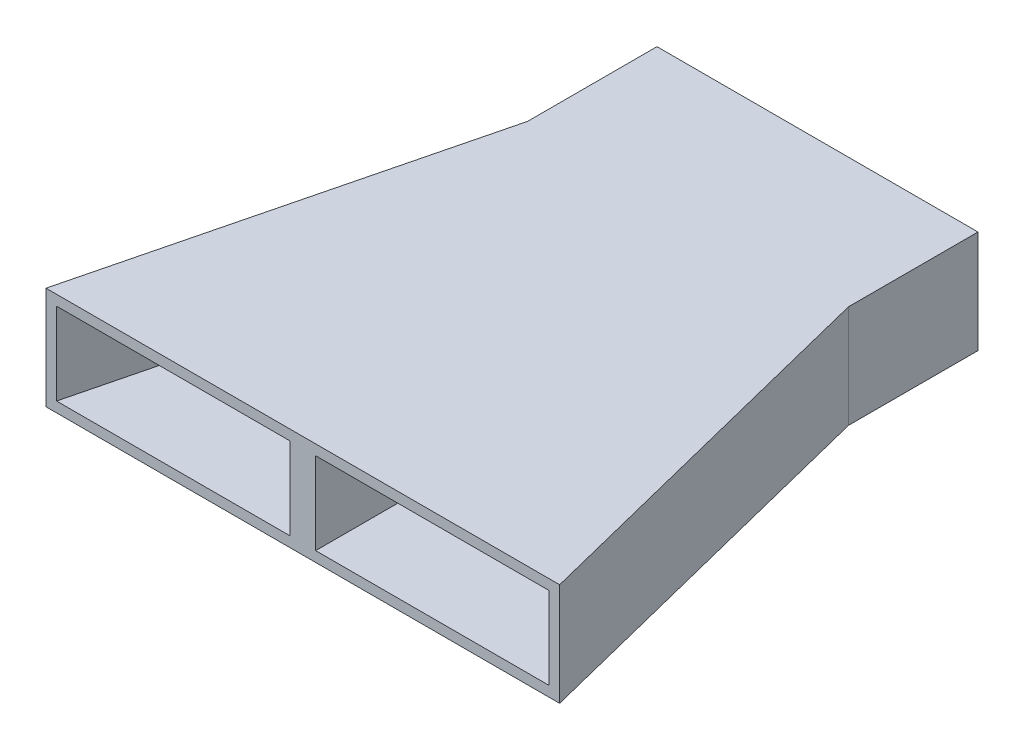
ISO-10303-21;
HEADER;
FILE_DESCRIPTION(('STEP AP214'),'2;1');
FILE_NAME('part.step','',(''),(''),'','','');
FILE_SCHEMA(('AUTOMOTIVE_DESIGN { 1 0 10303 214 1 1 1 1 }'));
ENDSEC;
DATA;
#1=APPLICATION_CONTEXT('core data for automotive mechanical design processes');
#2=APPLICATION_PROTOCOL_DEFINITION('international standard','automotive_design',2000,#1);
#3=PRODUCT_CONTEXT('',#1,'mechanical');
#4=PRODUCT('Part','Part','',(#3));
#5=PRODUCT_RELATED_PRODUCT_CATEGORY('part','',(#4));
#6=PRODUCT_DEFINITION_FORMATION('','',#4);
#7=PRODUCT_DEFINITION_CONTEXT('part definition',#1,'design');
#8=PRODUCT_DEFINITION('design','',#6,#7);
#9=PRODUCT_DEFINITION_SHAPE('','',#8);
#10=(LENGTH_UNIT() NAMED_UNIT(*) SI_UNIT(.MILLI.,.METRE.));
#11=(NAMED_UNIT(*) PLANE_ANGLE_UNIT() SI_UNIT($,.RADIAN.));
#12=(NAMED_UNIT(*) SI_UNIT($,.STERADIAN.) SOLID_ANGLE_UNIT());
#13=UNCERTAINTY_MEASURE_WITH_UNIT(LENGTH_MEASURE(1.E-05),#10,'distance_accuracy_value','');
#14=(GEOMETRIC_REPRESENTATION_CONTEXT(3) GLOBAL_UNCERTAINTY_ASSIGNED_CONTEXT((#13)) GLOBAL_UNIT_ASSIGNED_CONTEXT((#10,
#11,#12)) REPRESENTATION_CONTEXT('',''));
#15=CARTESIAN_POINT('',(0.,0.,0.));
#16=DIRECTION('',(0.,0.,1.));
#17=DIRECTION('',(1.,0.,0.));
#18=AXIS2_PLACEMENT_3D('',#15,#16,#17);
#19=CARTESIAN_POINT('',(-7.9375,4.572,-25.4508));
#20=DIRECTION('',(0.,-1.,0.));
#21=DIRECTION('',(0.,0.,-1.));
#22=AXIS2_PLACEMENT_3D('',#19,#20,#21);
#23=PLANE('',#22);
#24=DIRECTION('',(1.,0.,0.));
#25=VECTOR('',#24,1.);
#26=CARTESIAN_POINT('',(-7.9375,4.572,0.));
#27=LINE('',#26,#25);
#28=CARTESIAN_POINT('',(0.635,4.57199999999602,0.));
#29=VERTEX_POINT('',#28);
#30=CARTESIAN_POINT('',(12.1763655855466,4.572,0.));
#31=VERTEX_POINT('',#30);
#32=EDGE_CURVE('E168',#29,#31,#27,.T.);
#33=ORIENTED_EDGE('',*,*,#32,.F.);
#34=DIRECTION('',(0.,0.,1.));
#35=VECTOR('',#34,1.);
#36=CARTESIAN_POINT('',(0.635,4.57199999999602,-25.4508));
#37=LINE('',#36,#35);
#38=CARTESIAN_POINT('',(0.635,4.57199999999602,-25.4508));
#39=VERTEX_POINT('',#38);
#40=EDGE_CURVE('E161',#39,#29,#37,.T.);
#41=ORIENTED_EDGE('',*,*,#40,.F.);
#42=DIRECTION('',(-1.,0.,0.));
#43=VECTOR('',#42,1.);
#44=CARTESIAN_POINT('',(-7.9375,4.572,-25.4508));
#45=LINE('',#44,#43);
#46=CARTESIAN_POINT('',(7.4295,4.572,-25.4508));
#47=VERTEX_POINT('',#46);
#48=EDGE_CURVE('E288',#47,#39,#45,.T.);
#49=ORIENTED_EDGE('',*,*,#48,.F.);
#50=DIRECTION('',(0.,0.,-1.));
#51=VECTOR('',#50,1.);
#52=CARTESIAN_POINT('',(7.4295,4.572,-25.4508));
#53=LINE('',#52,#51);
#54=CARTESIAN_POINT('',(7.4295,4.572,-18.9874623421862));
#55=VERTEX_POINT('',#54);
#56=EDGE_CURVE('E170',#55,#47,#53,.T.);
#57=ORIENTED_EDGE('',*,*,#56,.F.);
#58=DIRECTION('',(-0.242535625036333,0.,-0.970142500145332));
#59=VECTOR('',#58,1.);
#60=CARTESIAN_POINT('',(5.00477349227911,4.572,-28.6863683730698));
#61=LINE('',#60,#59);
#62=EDGE_CURVE('E167',#31,#55,#61,.T.);
#63=ORIENTED_EDGE('',*,*,#62,.F.);
#64=EDGE_LOOP('',(#33,#41,#49,#57,#63));
#65=FACE_BOUND('',#64,.T.);
#66=ADVANCED_FACE('F30',(#65),#23,.T.);
#67=CARTESIAN_POINT('',(-0.635,4.572,-25.4508));
#68=VERTEX_POINT('',#67);
#69=CARTESIAN_POINT('',(-7.4295,4.572,-25.4508));
#70=VERTEX_POINT('',#69);
#71=EDGE_CURVE('E160',#68,#70,#45,.T.);
#72=ORIENTED_EDGE('',*,*,#71,.F.);
#73=DIRECTION('',(0.,0.,-1.));
#74=VECTOR('',#73,1.);
#75=CARTESIAN_POINT('',(-0.635,4.57199999999602,-25.4508));
#76=LINE('',#75,#74);
#77=CARTESIAN_POINT('',(-0.635,4.57199999999602,0.));
#78=VERTEX_POINT('',#77);
#79=EDGE_CURVE('E146',#78,#68,#76,.T.);
#80=ORIENTED_EDGE('',*,*,#79,.F.);
#81=CARTESIAN_POINT('',(-12.1763655855466,4.572,0.));
#82=VERTEX_POINT('',#81);
#83=EDGE_CURVE('E157',#82,#78,#27,.T.);
#84=ORIENTED_EDGE('',*,*,#83,.F.);
#85=DIRECTION('',(-0.242535625036333,0.,0.970142500145332));
#86=VECTOR('',#85,1.);
#87=CARTESIAN_POINT('',(-5.93859702169088,4.572,-24.9510742554227));
#88=LINE('',#87,#86);
#89=CARTESIAN_POINT('',(-7.4295,4.572,-18.9874623421862));
#90=VERTEX_POINT('',#89);
#91=EDGE_CURVE('E172',#90,#82,#88,.T.);
#92=ORIENTED_EDGE('',*,*,#91,.F.);
#93=DIRECTION('',(0.,0.,1.));
#94=VECTOR('',#93,1.);
#95=CARTESIAN_POINT('',(-7.4295,4.572,-25.4508));
#96=LINE('',#95,#94);
#97=EDGE_CURVE('E255',#70,#90,#96,.T.);
#98=ORIENTED_EDGE('',*,*,#97,.F.);
#99=EDGE_LOOP('',(#72,#80,#84,#92,#98));
#100=FACE_BOUND('',#99,.T.);
#101=ADVANCED_FACE('F156',(#100),#23,.T.);
#102=CARTESIAN_POINT('',(-7.9375,0.508,-25.4508));
#103=DIRECTION('',(0.,-1.,0.));
#104=DIRECTION('',(0.,0.,-1.));
#105=AXIS2_PLACEMENT_3D('',#102,#103,#104);
#106=PLANE('',#105);
#107=DIRECTION('',(0.,0.,-1.));
#108=VECTOR('',#107,1.);
#109=CARTESIAN_POINT('',(0.635,0.508,-25.4508));
#110=LINE('',#109,#108);
#111=CARTESIAN_POINT('',(0.635,0.508,0.));
#112=VERTEX_POINT('',#111);
#113=CARTESIAN_POINT('',(0.635,0.508,-25.4508));
#114=VERTEX_POINT('',#113);
#115=EDGE_CURVE('E275',#112,#114,#110,.T.);
#116=ORIENTED_EDGE('',*,*,#115,.F.);
#117=DIRECTION('',(1.,0.,0.));
#118=VECTOR('',#117,1.);
#119=CARTESIAN_POINT('',(-7.9375,0.508,0.));
#120=LINE('',#119,#118);
#121=CARTESIAN_POINT('',(12.1763655855466,0.508,0.));
#122=VERTEX_POINT('',#121);
#123=EDGE_CURVE('E266',#112,#122,#120,.T.);
#124=ORIENTED_EDGE('',*,*,#123,.T.);
#125=DIRECTION('',(-0.242535625036333,0.,-0.970142500145332));
#126=VECTOR('',#125,1.);
#127=CARTESIAN_POINT('',(5.00477349227911,0.508,-28.6863683730698));
#128=LINE('',#127,#126);
#129=CARTESIAN_POINT('',(7.4295,0.508,-18.9874623421862));
#130=VERTEX_POINT('',#129);
#131=EDGE_CURVE('E265',#122,#130,#128,.T.);
#132=ORIENTED_EDGE('',*,*,#131,.T.);
#133=DIRECTION('',(0.,0.,-1.));
#134=VECTOR('',#133,1.);
#135=CARTESIAN_POINT('',(7.4295,0.508,-25.4508));
#136=LINE('',#135,#134);
#137=CARTESIAN_POINT('',(7.4295,0.508,-25.4508));
#138=VERTEX_POINT('',#137);
#139=EDGE_CURVE('E260',#130,#138,#136,.T.);
#140=ORIENTED_EDGE('',*,*,#139,.T.);
#141=DIRECTION('',(-1.,0.,0.));
#142=VECTOR('',#141,1.);
#143=CARTESIAN_POINT('',(-7.9375,0.508,-25.4508));
#144=LINE('',#143,#142);
#145=EDGE_CURVE('E53',#138,#114,#144,.T.);
#146=ORIENTED_EDGE('',*,*,#145,.T.);
#147=EDGE_LOOP('',(#116,#124,#132,#140,#146));
#148=FACE_BOUND('',#147,.T.);
#149=ADVANCED_FACE('F321',(#148),#106,.F.);
#150=DIRECTION('',(0.,0.,1.));
#151=VECTOR('',#150,1.);
#152=CARTESIAN_POINT('',(-0.635,0.508,-25.4508));
#153=LINE('',#152,#151);
#154=CARTESIAN_POINT('',(-0.635,0.508,-25.4508));
#155=VERTEX_POINT('',#154);
#156=CARTESIAN_POINT('',(-0.635,0.508,0.));
#157=VERTEX_POINT('',#156);
#158=EDGE_CURVE('E149',#155,#157,#153,.T.);
#159=ORIENTED_EDGE('',*,*,#158,.F.);
#160=CARTESIAN_POINT('',(-7.4295,0.508,-25.4508));
#161=VERTEX_POINT('',#160);
#162=EDGE_CURVE('E256',#155,#161,#144,.T.);
#163=ORIENTED_EDGE('',*,*,#162,.T.);
#164=DIRECTION('',(0.,0.,1.));
#165=VECTOR('',#164,1.);
#166=CARTESIAN_POINT('',(-7.4295,0.508,-25.4508));
#167=LINE('',#166,#165);
#168=CARTESIAN_POINT('',(-7.4295,0.508,-18.9874623421862));
#169=VERTEX_POINT('',#168);
#170=EDGE_CURVE('E272',#161,#169,#167,.T.);
#171=ORIENTED_EDGE('',*,*,#170,.T.);
#172=DIRECTION('',(-0.242535625036333,0.,0.970142500145332));
#173=VECTOR('',#172,1.);
#174=CARTESIAN_POINT('',(-5.93859702169088,0.508,-24.9510742554227));
#175=LINE('',#174,#173);
#176=CARTESIAN_POINT('',(-12.1763655855466,0.508,0.));
#177=VERTEX_POINT('',#176);
#178=EDGE_CURVE('E269',#169,#177,#175,.T.);
#179=ORIENTED_EDGE('',*,*,#178,.T.);
#180=EDGE_CURVE('E264',#177,#157,#120,.T.);
#181=ORIENTED_EDGE('',*,*,#180,.T.);
#182=EDGE_LOOP('',(#159,#163,#171,#179,#181));
#183=FACE_BOUND('',#182,.T.);
#184=ADVANCED_FACE('F323',(#183),#106,.F.);
#185=CARTESIAN_POINT('',(12.7,5.08,0.));
#186=DIRECTION('',(0.,0.,-1.));
#187=DIRECTION('',(-1.,0.,0.));
#188=AXIS2_PLACEMENT_3D('',#185,#186,#187);
#189=PLANE('',#188);
#190=DIRECTION('',(0.,-1.,0.));
#191=VECTOR('',#190,1.);
#192=CARTESIAN_POINT('',(0.635,500000.,0.));
#193=LINE('',#192,#191);
#194=EDGE_CURVE('E153',#29,#112,#193,.T.);
#195=ORIENTED_EDGE('',*,*,#194,.F.);
#196=ORIENTED_EDGE('',*,*,#32,.T.);
#197=DIRECTION('',(0.,-1.,0.));
#198=VECTOR('',#197,1.);
#199=CARTESIAN_POINT('',(12.1763655855466,5.08,0.));
#200=LINE('',#199,#198);
#201=EDGE_CURVE('E175',#31,#122,#200,.T.);
#202=ORIENTED_EDGE('',*,*,#201,.T.);
#203=ORIENTED_EDGE('',*,*,#123,.F.);
#204=EDGE_LOOP('',(#195,#196,#202,#203));
#205=FACE_BOUND('',#204,.T.);
#206=DIRECTION('',(1.,0.,0.));
#207=VECTOR('',#206,1.);
#208=CARTESIAN_POINT('',(12.7,0.,0.));
#209=LINE('',#208,#207);
#210=CARTESIAN_POINT('',(-12.7,0.,0.));
#211=VERTEX_POINT('',#210);
#212=CARTESIAN_POINT('',(12.7,0.,0.));
#213=VERTEX_POINT('',#212);
#214=EDGE_CURVE('E198',#211,#213,#209,.T.);
#215=ORIENTED_EDGE('',*,*,#214,.T.);
#216=DIRECTION('',(0.,-1.,0.));
#217=VECTOR('',#216,1.);
#218=CARTESIAN_POINT('',(12.7,5.08,0.));
#219=LINE('',#218,#217);
#220=CARTESIAN_POINT('',(12.7,5.08,0.));
#221=VERTEX_POINT('',#220);
#222=EDGE_CURVE('E213',#221,#213,#219,.T.);
#223=ORIENTED_EDGE('',*,*,#222,.F.);
#224=DIRECTION('',(1.,0.,0.));
#225=VECTOR('',#224,1.);
#226=CARTESIAN_POINT('',(12.7,5.08,0.));
#227=LINE('',#226,#225);
#228=CARTESIAN_POINT('',(-12.7,5.08,0.));
#229=VERTEX_POINT('',#228);
#230=EDGE_CURVE('E183',#229,#221,#227,.T.);
#231=ORIENTED_EDGE('',*,*,#230,.F.);
#232=DIRECTION('',(0.,-1.,0.));
#233=VECTOR('',#232,1.);
#234=CARTESIAN_POINT('',(-12.7,5.08,0.));
#235=LINE('',#234,#233);
#236=EDGE_CURVE('E38',#229,#211,#235,.T.);
#237=ORIENTED_EDGE('',*,*,#236,.T.);
#238=EDGE_LOOP('',(#215,#223,#231,#237));
#239=FACE_BOUND('',#238,.T.);
#240=ORIENTED_EDGE('',*,*,#180,.F.);
#241=DIRECTION('',(0.,-1.,0.));
#242=VECTOR('',#241,1.);
#243=CARTESIAN_POINT('',(-12.1763655855466,5.08,0.));
#244=LINE('',#243,#242);
#245=EDGE_CURVE('E166',#82,#177,#244,.T.);
#246=ORIENTED_EDGE('',*,*,#245,.F.);
#247=ORIENTED_EDGE('',*,*,#83,.T.);
#248=DIRECTION('',(0.,-1.,0.));
#249=VECTOR('',#248,1.);
#250=CARTESIAN_POINT('',(-0.635,500000.,0.));
#251=LINE('',#250,#249);
#252=EDGE_CURVE('E143',#78,#157,#251,.T.);
#253=ORIENTED_EDGE('',*,*,#252,.T.);
#254=EDGE_LOOP('',(#240,#246,#247,#253));
#255=FACE_BOUND('',#254,.T.);
#256=ADVANCED_FACE('F164',(#205,#239,#255),#189,.F.);
#257=CARTESIAN_POINT('',(-7.9375,5.08,-25.4508));
#258=DIRECTION('',(0.,0.,1.));
#259=DIRECTION('',(1.,0.,0.));
#260=AXIS2_PLACEMENT_3D('',#257,#258,#259);
#261=PLANE('',#260);
#262=DIRECTION('',(0.,-1.,0.));
#263=VECTOR('',#262,1.);
#264=CARTESIAN_POINT('',(-0.635,500000.,-25.4508));
#265=LINE('',#264,#263);
#266=EDGE_CURVE('E45',#68,#155,#265,.T.);
#267=ORIENTED_EDGE('',*,*,#266,.F.);
#268=ORIENTED_EDGE('',*,*,#71,.T.);
#269=DIRECTION('',(0.,-1.,0.));
#270=VECTOR('',#269,1.);
#271=CARTESIAN_POINT('',(-7.4295,5.08,-25.4508));
#272=LINE('',#271,#270);
#273=EDGE_CURVE('E286',#70,#161,#272,.T.);
#274=ORIENTED_EDGE('',*,*,#273,.T.);
#275=ORIENTED_EDGE('',*,*,#162,.F.);
#276=EDGE_LOOP('',(#267,#268,#274,#275));
#277=FACE_BOUND('',#276,.T.);
#278=DIRECTION('',(-1.,0.,0.));
#279=VECTOR('',#278,1.);
#280=CARTESIAN_POINT('',(-7.9375,0.,-25.4508));
#281=LINE('',#280,#279);
#282=CARTESIAN_POINT('',(7.9375,0.,-25.4508));
#283=VERTEX_POINT('',#282);
#284=CARTESIAN_POINT('',(-7.9375,0.,-25.4508));
#285=VERTEX_POINT('',#284);
#286=EDGE_CURVE('E181',#283,#285,#281,.T.);
#287=ORIENTED_EDGE('',*,*,#286,.T.);
#288=DIRECTION('',(0.,-1.,0.));
#289=VECTOR('',#288,1.);
#290=CARTESIAN_POINT('',(-7.9375,5.08,-25.4508));
#291=LINE('',#290,#289);
#292=CARTESIAN_POINT('',(-7.9375,5.08,-25.4508));
#293=VERTEX_POINT('',#292);
#294=EDGE_CURVE('E191',#293,#285,#291,.T.);
#295=ORIENTED_EDGE('',*,*,#294,.F.);
#296=DIRECTION('',(-1.,0.,0.));
#297=VECTOR('',#296,1.);
#298=CARTESIAN_POINT('',(-7.9375,5.08,-25.4508));
#299=LINE('',#298,#297);
#300=CARTESIAN_POINT('',(7.9375,5.08,-25.4508));
#301=VERTEX_POINT('',#300);
#302=EDGE_CURVE('E189',#301,#293,#299,.T.);
#303=ORIENTED_EDGE('',*,*,#302,.F.);
#304=DIRECTION('',(0.,-1.,0.));
#305=VECTOR('',#304,1.);
#306=CARTESIAN_POINT('',(7.9375,5.08,-25.4508));
#307=LINE('',#306,#305);
#308=EDGE_CURVE('E207',#301,#283,#307,.T.);
#309=ORIENTED_EDGE('',*,*,#308,.T.);
#310=EDGE_LOOP('',(#287,#295,#303,#309));
#311=FACE_BOUND('',#310,.T.);
#312=ORIENTED_EDGE('',*,*,#145,.F.);
#313=DIRECTION('',(0.,-1.,0.));
#314=VECTOR('',#313,1.);
#315=CARTESIAN_POINT('',(7.4295,5.08,-25.4508));
#316=LINE('',#315,#314);
#317=EDGE_CURVE('E252',#47,#138,#316,.T.);
#318=ORIENTED_EDGE('',*,*,#317,.F.);
#319=ORIENTED_EDGE('',*,*,#48,.T.);
#320=DIRECTION('',(0.,-1.,0.));
#321=VECTOR('',#320,1.);
#322=CARTESIAN_POINT('',(0.635,500000.,-25.4508));
#323=LINE('',#322,#321);
#324=EDGE_CURVE('E253',#39,#114,#323,.T.);
#325=ORIENTED_EDGE('',*,*,#324,.T.);
#326=EDGE_LOOP('',(#312,#318,#319,#325));
#327=FACE_BOUND('',#326,.T.);
#328=ADVANCED_FACE('F245',(#277,#311,#327),#261,.F.);
#329=CARTESIAN_POINT('',(-7.9375,5.08,-19.05));
#330=DIRECTION('',(1.,0.,0.));
#331=DIRECTION('',(0.,0.,-1.));
#332=AXIS2_PLACEMENT_3D('',#329,#330,#331);
#333=PLANE('',#332);
#334=DIRECTION('',(0.,0.,1.));
#335=VECTOR('',#334,1.);
#336=CARTESIAN_POINT('',(-7.9375,0.,-19.05));
#337=LINE('',#336,#335);
#338=CARTESIAN_POINT('',(-7.9375,0.,-19.05));
#339=VERTEX_POINT('',#338);
#340=EDGE_CURVE('E192',#285,#339,#337,.T.);
#341=ORIENTED_EDGE('',*,*,#340,.T.);
#342=DIRECTION('',(0.,-1.,0.));
#343=VECTOR('',#342,1.);
#344=CARTESIAN_POINT('',(-7.9375,5.08,-19.05));
#345=LINE('',#344,#343);
#346=CARTESIAN_POINT('',(-7.9375,5.08,-19.05));
#347=VERTEX_POINT('',#346);
#348=EDGE_CURVE('E11',#347,#339,#345,.T.);
#349=ORIENTED_EDGE('',*,*,#348,.F.);
#350=DIRECTION('',(0.,0.,1.));
#351=VECTOR('',#350,1.);
#352=CARTESIAN_POINT('',(-7.9375,5.08,-19.05));
#353=LINE('',#352,#351);
#354=EDGE_CURVE('E177',#293,#347,#353,.T.);
#355=ORIENTED_EDGE('',*,*,#354,.F.);
#356=ORIENTED_EDGE('',*,*,#294,.T.);
#357=EDGE_LOOP('',(#341,#349,#355,#356));
#358=FACE_BOUND('',#357,.T.);
#359=ADVANCED_FACE('F32',(#358),#333,.F.);
#360=CARTESIAN_POINT('',(-12.7,5.08,0.));
#361=DIRECTION('',(0.970142500145332,0.,0.242535625036333));
#362=DIRECTION('',(0.242535625036333,0.,-0.970142500145332));
#363=AXIS2_PLACEMENT_3D('',#360,#361,#362);
#364=PLANE('',#363);
#365=DIRECTION('',(-0.242535625036333,0.,0.970142500145332));
#366=VECTOR('',#365,1.);
#367=CARTESIAN_POINT('',(-12.7,0.,0.));
#368=LINE('',#367,#366);
#369=EDGE_CURVE('E195',#339,#211,#368,.T.);
#370=ORIENTED_EDGE('',*,*,#369,.T.);
#371=ORIENTED_EDGE('',*,*,#236,.F.);
#372=DIRECTION('',(-0.242535625036333,0.,0.970142500145332));
#373=VECTOR('',#372,1.);
#374=CARTESIAN_POINT('',(-12.7,5.08,0.));
#375=LINE('',#374,#373);
#376=EDGE_CURVE('E180',#347,#229,#375,.T.);
#377=ORIENTED_EDGE('',*,*,#376,.F.);
#378=ORIENTED_EDGE('',*,*,#348,.T.);
#379=EDGE_LOOP('',(#370,#371,#377,#378));
#380=FACE_BOUND('',#379,.T.);
#381=ADVANCED_FACE('F242',(#380),#364,.F.);
#382=CARTESIAN_POINT('',(12.7,5.08,0.));
#383=DIRECTION('',(-0.970142500145332,0.,0.242535625036333));
#384=DIRECTION('',(0.242535625036333,0.,0.970142500145332));
#385=AXIS2_PLACEMENT_3D('',#382,#383,#384);
#386=PLANE('',#385);
#387=DIRECTION('',(-0.242535625036333,0.,-0.970142500145332));
#388=VECTOR('',#387,1.);
#389=CARTESIAN_POINT('',(12.7,0.,0.));
#390=LINE('',#389,#388);
#391=CARTESIAN_POINT('',(7.9375,0.,-19.05));
#392=VERTEX_POINT('',#391);
#393=EDGE_CURVE('E200',#213,#392,#390,.T.);
#394=ORIENTED_EDGE('',*,*,#393,.T.);
#395=DIRECTION('',(0.,-1.,0.));
#396=VECTOR('',#395,1.);
#397=CARTESIAN_POINT('',(7.9375,5.08,-19.05));
#398=LINE('',#397,#396);
#399=CARTESIAN_POINT('',(7.9375,5.08,-19.05));
#400=VERTEX_POINT('',#399);
#401=EDGE_CURVE('E210',#400,#392,#398,.T.);
#402=ORIENTED_EDGE('',*,*,#401,.F.);
#403=DIRECTION('',(-0.242535625036333,0.,-0.970142500145332));
#404=VECTOR('',#403,1.);
#405=CARTESIAN_POINT('',(12.7,5.08,0.));
#406=LINE('',#405,#404);
#407=EDGE_CURVE('E185',#221,#400,#406,.T.);
#408=ORIENTED_EDGE('',*,*,#407,.F.);
#409=ORIENTED_EDGE('',*,*,#222,.T.);
#410=EDGE_LOOP('',(#394,#402,#408,#409));
#411=FACE_BOUND('',#410,.T.);
#412=ADVANCED_FACE('F230',(#411),#386,.F.);
#413=CARTESIAN_POINT('',(7.9375,5.08,-25.4508));
#414=DIRECTION('',(-1.,0.,0.));
#415=DIRECTION('',(0.,0.,1.));
#416=AXIS2_PLACEMENT_3D('',#413,#414,#415);
#417=PLANE('',#416);
#418=DIRECTION('',(0.,0.,-1.));
#419=VECTOR('',#418,1.);
#420=CARTESIAN_POINT('',(7.9375,0.,-25.4508));
#421=LINE('',#420,#419);
#422=EDGE_CURVE('E202',#392,#283,#421,.T.);
#423=ORIENTED_EDGE('',*,*,#422,.T.);
#424=ORIENTED_EDGE('',*,*,#308,.F.);
#425=DIRECTION('',(0.,0.,-1.));
#426=VECTOR('',#425,1.);
#427=CARTESIAN_POINT('',(7.9375,5.08,-25.4508));
#428=LINE('',#427,#426);
#429=EDGE_CURVE('E187',#400,#301,#428,.T.);
#430=ORIENTED_EDGE('',*,*,#429,.F.);
#431=ORIENTED_EDGE('',*,*,#401,.T.);
#432=EDGE_LOOP('',(#423,#424,#430,#431));
#433=FACE_BOUND('',#432,.T.);
#434=ADVANCED_FACE('F234',(#433),#417,.F.);
#435=CARTESIAN_POINT('',(-7.9375,5.08,-25.4508));
#436=DIRECTION('',(0.,-1.,0.));
#437=DIRECTION('',(0.,0.,-1.));
#438=AXIS2_PLACEMENT_3D('',#435,#436,#437);
#439=PLANE('',#438);
#440=ORIENTED_EDGE('',*,*,#354,.T.);
#441=ORIENTED_EDGE('',*,*,#376,.T.);
#442=ORIENTED_EDGE('',*,*,#230,.T.);
#443=ORIENTED_EDGE('',*,*,#407,.T.);
#444=ORIENTED_EDGE('',*,*,#429,.T.);
#445=ORIENTED_EDGE('',*,*,#302,.T.);
#446=EDGE_LOOP('',(#440,#441,#442,#443,#444,#445));
#447=FACE_BOUND('',#446,.T.);
#448=ADVANCED_FACE('F238',(#447),#439,.F.);
#449=CARTESIAN_POINT('',(-7.9375,0.,-25.4508));
#450=DIRECTION('',(0.,-1.,0.));
#451=DIRECTION('',(0.,0.,-1.));
#452=AXIS2_PLACEMENT_3D('',#449,#450,#451);
#453=PLANE('',#452);
#454=ORIENTED_EDGE('',*,*,#340,.F.);
#455=ORIENTED_EDGE('',*,*,#286,.F.);
#456=ORIENTED_EDGE('',*,*,#422,.F.);
#457=ORIENTED_EDGE('',*,*,#393,.F.);
#458=ORIENTED_EDGE('',*,*,#214,.F.);
#459=ORIENTED_EDGE('',*,*,#369,.F.);
#460=EDGE_LOOP('',(#454,#455,#456,#457,#458,#459));
#461=FACE_BOUND('',#460,.T.);
#462=ADVANCED_FACE('F225',(#461),#453,.T.);
#463=CARTESIAN_POINT('',(-7.4295,5.08,-19.05));
#464=DIRECTION('',(1.,0.,0.));
#465=DIRECTION('',(0.,0.,-1.));
#466=AXIS2_PLACEMENT_3D('',#463,#464,#465);
#467=PLANE('',#466);
#468=ORIENTED_EDGE('',*,*,#170,.F.);
#469=ORIENTED_EDGE('',*,*,#273,.F.);
#470=ORIENTED_EDGE('',*,*,#97,.T.);
#471=DIRECTION('',(0.,-1.,0.));
#472=VECTOR('',#471,1.);
#473=CARTESIAN_POINT('',(-7.4295,5.08,-18.9874623421862));
#474=LINE('',#473,#472);
#475=EDGE_CURVE('E196',#90,#169,#474,.T.);
#476=ORIENTED_EDGE('',*,*,#475,.T.);
#477=EDGE_LOOP('',(#468,#469,#470,#476));
#478=FACE_BOUND('',#477,.T.);
#479=ADVANCED_FACE('F292',(#478),#467,.T.);
#480=CARTESIAN_POINT('',(-12.2071676099262,5.08,0.123208097518461));
#481=DIRECTION('',(0.970142500145332,0.,0.242535625036333));
#482=DIRECTION('',(0.242535625036333,0.,-0.970142500145332));
#483=AXIS2_PLACEMENT_3D('',#480,#481,#482);
#484=PLANE('',#483);
#485=ORIENTED_EDGE('',*,*,#178,.F.);
#486=ORIENTED_EDGE('',*,*,#475,.F.);
#487=ORIENTED_EDGE('',*,*,#91,.T.);
#488=ORIENTED_EDGE('',*,*,#245,.T.);
#489=EDGE_LOOP('',(#485,#486,#487,#488));
#490=FACE_BOUND('',#489,.T.);
#491=ADVANCED_FACE('F296',(#490),#484,.T.);
#492=CARTESIAN_POINT('',(12.2071676099262,5.08,0.123208097518461));
#493=DIRECTION('',(-0.970142500145332,0.,0.242535625036333));
#494=DIRECTION('',(0.242535625036333,0.,0.970142500145332));
#495=AXIS2_PLACEMENT_3D('',#492,#493,#494);
#496=PLANE('',#495);
#497=ORIENTED_EDGE('',*,*,#131,.F.);
#498=ORIENTED_EDGE('',*,*,#201,.F.);
#499=ORIENTED_EDGE('',*,*,#62,.T.);
#500=DIRECTION('',(0.,-1.,0.));
#501=VECTOR('',#500,1.);
#502=CARTESIAN_POINT('',(7.4295,5.08,-18.9874623421862));
#503=LINE('',#502,#501);
#504=EDGE_CURVE('E282',#55,#130,#503,.T.);
#505=ORIENTED_EDGE('',*,*,#504,.T.);
#506=EDGE_LOOP('',(#497,#498,#499,#505));
#507=FACE_BOUND('',#506,.T.);
#508=ADVANCED_FACE('F317',(#507),#496,.T.);
#509=CARTESIAN_POINT('',(7.4295,5.08,-25.4508));
#510=DIRECTION('',(-1.,0.,0.));
#511=DIRECTION('',(0.,0.,1.));
#512=AXIS2_PLACEMENT_3D('',#509,#510,#511);
#513=PLANE('',#512);
#514=ORIENTED_EDGE('',*,*,#139,.F.);
#515=ORIENTED_EDGE('',*,*,#504,.F.);
#516=ORIENTED_EDGE('',*,*,#56,.T.);
#517=ORIENTED_EDGE('',*,*,#317,.T.);
#518=EDGE_LOOP('',(#514,#515,#516,#517));
#519=FACE_BOUND('',#518,.T.);
#520=ADVANCED_FACE('F320',(#519),#513,.T.);
#521=CARTESIAN_POINT('',(0.635,500000.,-25.4508));
#522=DIRECTION('',(-1.,0.,0.));
#523=DIRECTION('',(0.,0.,1.));
#524=AXIS2_PLACEMENT_3D('',#521,#522,#523);
#525=PLANE('',#524);
#526=ORIENTED_EDGE('',*,*,#324,.F.);
#527=ORIENTED_EDGE('',*,*,#40,.T.);
#528=ORIENTED_EDGE('',*,*,#194,.T.);
#529=ORIENTED_EDGE('',*,*,#115,.T.);
#530=EDGE_LOOP('',(#526,#527,#528,#529));
#531=FACE_BOUND('',#530,.T.);
#532=ADVANCED_FACE('F307',(#531),#525,.F.);
#533=CARTESIAN_POINT('',(-0.635,500000.,-25.4508));
#534=DIRECTION('',(1.,0.,0.));
#535=DIRECTION('',(0.,0.,-1.));
#536=AXIS2_PLACEMENT_3D('',#533,#534,#535);
#537=PLANE('',#536);
#538=ORIENTED_EDGE('',*,*,#252,.F.);
#539=ORIENTED_EDGE('',*,*,#79,.T.);
#540=ORIENTED_EDGE('',*,*,#266,.T.);
#541=ORIENTED_EDGE('',*,*,#158,.T.);
#542=EDGE_LOOP('',(#538,#539,#540,#541));
#543=FACE_BOUND('',#542,.T.);
#544=ADVANCED_FACE('F145',(#543),#537,.F.);
#545=CLOSED_SHELL('',(#66,#101,#149,#184,#256,#328,#359,#381,#412,#434,#448,#462,#479,#491,#508,
#520,#532,#544));
#546=MANIFOLD_SOLID_BREP('B2',#545);
#547=ADVANCED_BREP_SHAPE_REPRESENTATION('',(#18,#546),#14);
#548=SHAPE_DEFINITION_REPRESENTATION(#9,#547);
ENDSEC;
END-ISO-10303-21;
